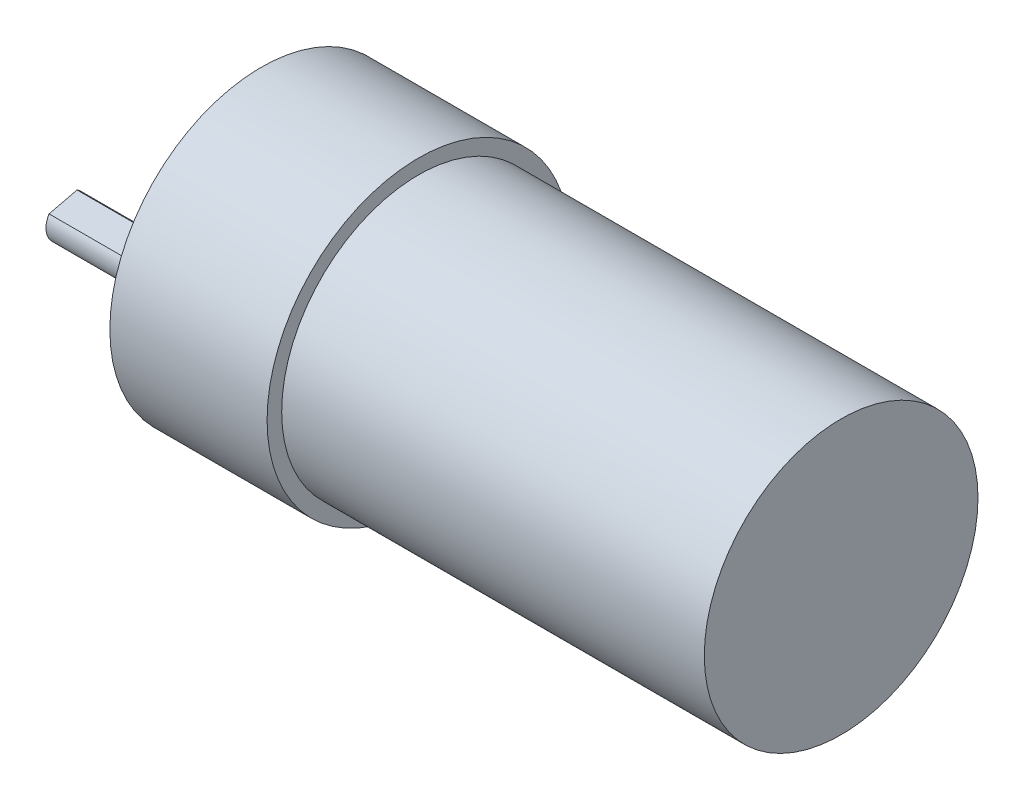
ISO-10303-21;
HEADER;
FILE_DESCRIPTION(('STEP AP214'),'2;1');
FILE_NAME('part.step','',(''),(''),'','','');
FILE_SCHEMA(('AUTOMOTIVE_DESIGN { 1 0 10303 214 1 1 1 1 }'));
ENDSEC;
DATA;
#1=APPLICATION_CONTEXT('core data for automotive mechanical design processes');
#2=APPLICATION_PROTOCOL_DEFINITION('international standard','automotive_design',2000,#1);
#3=PRODUCT_CONTEXT('',#1,'mechanical');
#4=PRODUCT('Part','Part','',(#3));
#5=PRODUCT_RELATED_PRODUCT_CATEGORY('part','',(#4));
#6=PRODUCT_DEFINITION_FORMATION('','',#4);
#7=PRODUCT_DEFINITION_CONTEXT('part definition',#1,'design');
#8=PRODUCT_DEFINITION('design','',#6,#7);
#9=PRODUCT_DEFINITION_SHAPE('','',#8);
#10=(LENGTH_UNIT() NAMED_UNIT(*) SI_UNIT(.MILLI.,.METRE.));
#11=(NAMED_UNIT(*) PLANE_ANGLE_UNIT() SI_UNIT($,.RADIAN.));
#12=(NAMED_UNIT(*) SI_UNIT($,.STERADIAN.) SOLID_ANGLE_UNIT());
#13=UNCERTAINTY_MEASURE_WITH_UNIT(LENGTH_MEASURE(1.E-05),#10,'distance_accuracy_value','');
#14=(GEOMETRIC_REPRESENTATION_CONTEXT(3) GLOBAL_UNCERTAINTY_ASSIGNED_CONTEXT((#13)) GLOBAL_UNIT_ASSIGNED_CONTEXT((#10,
#11,#12)) REPRESENTATION_CONTEXT('',''));
#15=CARTESIAN_POINT('',(0.,0.,0.));
#16=DIRECTION('',(0.,0.,1.));
#17=DIRECTION('',(1.,0.,0.));
#18=AXIS2_PLACEMENT_3D('',#15,#16,#17);
#19=CARTESIAN_POINT('',(-40.8432,-8.71855,0.));
#20=DIRECTION('',(1.,0.,0.));
#21=DIRECTION('',(0.,0.,-1.));
#22=AXIS2_PLACEMENT_3D('',#19,#20,#21);
#23=CYLINDRICAL_SURFACE('',#22,2.3749);
#24=CARTESIAN_POINT('',(-18.2372,-8.71855,0.));
#25=DIRECTION('',(-1.,0.,0.));
#26=DIRECTION('',(0.,0.,1.));
#27=AXIS2_PLACEMENT_3D('',#24,#25,#26);
#28=CIRCLE('',#27,2.3749);
#29=CARTESIAN_POINT('',(-18.2372,-8.71855,2.3749));
#30=VERTEX_POINT('',#29);
#31=EDGE_CURVE('E88',#30,#30,#28,.T.);
#32=ORIENTED_EDGE('',*,*,#31,.T.);
#33=EDGE_LOOP('',(#32));
#34=FACE_BOUND('',#33,.T.);
#35=DIRECTION('',(1.,0.,0.));
#36=VECTOR('',#35,1.);
#37=CARTESIAN_POINT('',(-40.8432,-6.68747817064265,-1.23081161596361));
#38=LINE('',#37,#36);
#39=CARTESIAN_POINT('',(-25.8572,-6.68747817064265,-1.23081161596361));
#40=VERTEX_POINT('',#39);
#41=CARTESIAN_POINT('',(-40.8432,-6.68747817064265,-1.23081161596361));
#42=VERTEX_POINT('',#41);
#43=EDGE_CURVE('E49',#40,#42,#38,.F.);
#44=ORIENTED_EDGE('',*,*,#43,.F.);
#45=CARTESIAN_POINT('',(-25.8572,-8.71855,0.));
#46=DIRECTION('',(1.,0.,0.));
#47=DIRECTION('',(0.,0.,-1.));
#48=AXIS2_PLACEMENT_3D('',#45,#46,#47);
#49=CIRCLE('',#48,2.3749);
#50=CARTESIAN_POINT('',(-25.8572,-7.46406700754952,2.01653723785416));
#51=VERTEX_POINT('',#50);
#52=EDGE_CURVE('E11',#40,#51,#49,.T.);
#53=ORIENTED_EDGE('',*,*,#52,.T.);
#54=DIRECTION('',(1.,0.,0.));
#55=VECTOR('',#54,1.);
#56=CARTESIAN_POINT('',(-40.8432,-7.46406700754952,2.01653723785416));
#57=LINE('',#56,#55);
#58=CARTESIAN_POINT('',(-40.8432,-7.46406700754952,2.01653723785416));
#59=VERTEX_POINT('',#58);
#60=EDGE_CURVE('E58',#59,#51,#57,.T.);
#61=ORIENTED_EDGE('',*,*,#60,.F.);
#62=CARTESIAN_POINT('',(-40.8432,-8.71855,0.));
#63=DIRECTION('',(-1.,0.,0.));
#64=DIRECTION('',(0.,0.,1.));
#65=AXIS2_PLACEMENT_3D('',#62,#63,#64);
#66=CIRCLE('',#65,2.3749);
#67=EDGE_CURVE('E70',#42,#59,#66,.T.);
#68=ORIENTED_EDGE('',*,*,#67,.F.);
#69=EDGE_LOOP('',(#44,#53,#61,#68));
#70=FACE_BOUND('',#69,.T.);
#71=ADVANCED_FACE('F34',(#34,#70),#23,.T.);
#72=CARTESIAN_POINT('',(-40.8432,-8.71855,0.));
#73=DIRECTION('',(-1.,0.,0.));
#74=DIRECTION('',(0.,0.,1.));
#75=AXIS2_PLACEMENT_3D('',#72,#73,#74);
#76=PLANE('',#75);
#77=ORIENTED_EDGE('',*,*,#67,.T.);
#78=DIRECTION('',(0.,0.232587064676617,-0.972575579245703));
#79=VECTOR('',#78,1.);
#80=CARTESIAN_POINT('',(-40.8432,-7.07577258909608,0.392862810945275));
#81=LINE('',#80,#79);
#82=EDGE_CURVE('E42',#59,#42,#81,.T.);
#83=ORIENTED_EDGE('',*,*,#82,.T.);
#84=EDGE_LOOP('',(#77,#83));
#85=FACE_BOUND('',#84,.T.);
#86=ADVANCED_FACE('F106',(#85),#76,.T.);
#87=CARTESIAN_POINT('',(-18.2372,0.,0.));
#88=DIRECTION('',(-1.,0.,0.));
#89=DIRECTION('',(0.,0.,1.));
#90=AXIS2_PLACEMENT_3D('',#87,#88,#89);
#91=PLANE('',#90);
#92=CARTESIAN_POINT('',(-18.2372,-8.71855,-10.2108));
#93=DIRECTION('',(-1.,0.,0.));
#94=DIRECTION('',(0.,0.,1.));
#95=AXIS2_PLACEMENT_3D('',#92,#93,#94);
#96=CIRCLE('',#95,1.27);
#97=CARTESIAN_POINT('',(-18.2372,-8.71855,-8.9408));
#98=VERTEX_POINT('',#97);
#99=EDGE_CURVE('E65',#98,#98,#96,.T.);
#100=ORIENTED_EDGE('',*,*,#99,.F.);
#101=EDGE_LOOP('',(#100));
#102=FACE_BOUND('',#101,.T.);
#103=CARTESIAN_POINT('',(-18.2372,-8.71855,10.2108));
#104=DIRECTION('',(-1.,0.,0.));
#105=DIRECTION('',(0.,0.,1.));
#106=AXIS2_PLACEMENT_3D('',#103,#104,#105);
#107=CIRCLE('',#106,1.27);
#108=CARTESIAN_POINT('',(-18.2372,-8.71855,11.4808));
#109=VERTEX_POINT('',#108);
#110=EDGE_CURVE('E76',#109,#109,#107,.T.);
#111=ORIENTED_EDGE('',*,*,#110,.F.);
#112=EDGE_LOOP('',(#111));
#113=FACE_BOUND('',#112,.T.);
#114=CARTESIAN_POINT('',(-18.2372,13.45565,0.));
#115=DIRECTION('',(-1.,0.,0.));
#116=DIRECTION('',(0.,0.,1.));
#117=AXIS2_PLACEMENT_3D('',#114,#115,#116);
#118=CIRCLE('',#117,1.27);
#119=CARTESIAN_POINT('',(-18.2372,13.45565,1.27));
#120=VERTEX_POINT('',#119);
#121=EDGE_CURVE('E82',#120,#120,#118,.T.);
#122=ORIENTED_EDGE('',*,*,#121,.F.);
#123=EDGE_LOOP('',(#122));
#124=FACE_BOUND('',#123,.T.);
#125=CARTESIAN_POINT('',(-18.2372,0.,0.));
#126=DIRECTION('',(-1.,0.,0.));
#127=DIRECTION('',(0.,0.,1.));
#128=AXIS2_PLACEMENT_3D('',#125,#126,#127);
#129=CIRCLE('',#128,17.56918);
#130=CARTESIAN_POINT('',(-18.2372,0.,17.56918));
#131=VERTEX_POINT('',#130);
#132=EDGE_CURVE('E95',#131,#131,#129,.T.);
#133=ORIENTED_EDGE('',*,*,#132,.T.);
#134=EDGE_LOOP('',(#133));
#135=FACE_BOUND('',#134,.T.);
#136=ORIENTED_EDGE('',*,*,#31,.F.);
#137=EDGE_LOOP('',(#136));
#138=FACE_BOUND('',#137,.T.);
#139=ADVANCED_FACE('F108',(#102,#113,#124,#135,#138),#91,.T.);
#140=CARTESIAN_POINT('',(49.022,0.,0.));
#141=DIRECTION('',(-1.,0.,0.));
#142=DIRECTION('',(0.,0.,1.));
#143=AXIS2_PLACEMENT_3D('',#140,#141,#142);
#144=CYLINDRICAL_SURFACE('',#143,15.875);
#145=CARTESIAN_POINT('',(49.022,0.,0.));
#146=DIRECTION('',(1.,0.,0.));
#147=DIRECTION('',(0.,0.,-1.));
#148=AXIS2_PLACEMENT_3D('',#145,#146,#147);
#149=CIRCLE('',#148,15.875);
#150=CARTESIAN_POINT('',(49.022,0.,-15.875));
#151=VERTEX_POINT('',#150);
#152=EDGE_CURVE('E103',#151,#151,#149,.T.);
#153=ORIENTED_EDGE('',*,*,#152,.F.);
#154=EDGE_LOOP('',(#153));
#155=FACE_BOUND('',#154,.T.);
#156=CARTESIAN_POINT('',(0.,0.,0.));
#157=DIRECTION('',(-1.,0.,0.));
#158=DIRECTION('',(0.,0.,1.));
#159=AXIS2_PLACEMENT_3D('',#156,#157,#158);
#160=CIRCLE('',#159,15.875);
#161=CARTESIAN_POINT('',(0.,0.,15.875));
#162=VERTEX_POINT('',#161);
#163=EDGE_CURVE('E98',#162,#162,#160,.T.);
#164=ORIENTED_EDGE('',*,*,#163,.F.);
#165=EDGE_LOOP('',(#164));
#166=FACE_BOUND('',#165,.T.);
#167=ADVANCED_FACE('F36',(#155,#166),#144,.T.);
#168=CARTESIAN_POINT('',(49.022,0.,0.));
#169=DIRECTION('',(1.,0.,0.));
#170=DIRECTION('',(0.,0.,-1.));
#171=AXIS2_PLACEMENT_3D('',#168,#169,#170);
#172=PLANE('',#171);
#173=ORIENTED_EDGE('',*,*,#152,.T.);
#174=EDGE_LOOP('',(#173));
#175=FACE_BOUND('',#174,.T.);
#176=ADVANCED_FACE('F126',(#175),#172,.T.);
#177=CARTESIAN_POINT('',(0.,0.,0.));
#178=DIRECTION('',(-1.,0.,0.));
#179=DIRECTION('',(0.,0.,1.));
#180=AXIS2_PLACEMENT_3D('',#177,#178,#179);
#181=PLANE('',#180);
#182=CARTESIAN_POINT('',(0.,0.,0.));
#183=DIRECTION('',(-1.,0.,0.));
#184=DIRECTION('',(0.,0.,1.));
#185=AXIS2_PLACEMENT_3D('',#182,#183,#184);
#186=CIRCLE('',#185,17.56918);
#187=CARTESIAN_POINT('',(0.,0.,17.56918));
#188=VERTEX_POINT('',#187);
#189=EDGE_CURVE('E92',#188,#188,#186,.T.);
#190=ORIENTED_EDGE('',*,*,#189,.F.);
#191=EDGE_LOOP('',(#190));
#192=FACE_BOUND('',#191,.T.);
#193=ORIENTED_EDGE('',*,*,#163,.T.);
#194=EDGE_LOOP('',(#193));
#195=FACE_BOUND('',#194,.T.);
#196=ADVANCED_FACE('F122',(#192,#195),#181,.F.);
#197=CARTESIAN_POINT('',(-18.2372,0.,0.));
#198=DIRECTION('',(1.,0.,0.));
#199=DIRECTION('',(0.,0.,-1.));
#200=AXIS2_PLACEMENT_3D('',#197,#198,#199);
#201=CYLINDRICAL_SURFACE('',#200,17.56918);
#202=ORIENTED_EDGE('',*,*,#132,.F.);
#203=EDGE_LOOP('',(#202));
#204=FACE_BOUND('',#203,.T.);
#205=ORIENTED_EDGE('',*,*,#189,.T.);
#206=EDGE_LOOP('',(#205));
#207=FACE_BOUND('',#206,.T.);
#208=ADVANCED_FACE('F125',(#204,#207),#201,.T.);
#209=CARTESIAN_POINT('',(-8.2372,13.45565,0.));
#210=DIRECTION('',(-1.,0.,0.));
#211=DIRECTION('',(0.,0.,1.));
#212=AXIS2_PLACEMENT_3D('',#209,#210,#211);
#213=CYLINDRICAL_SURFACE('',#212,1.27);
#214=CARTESIAN_POINT('',(-8.2372,13.45565,0.));
#215=DIRECTION('',(-1.,0.,0.));
#216=DIRECTION('',(0.,0.,1.));
#217=AXIS2_PLACEMENT_3D('',#214,#215,#216);
#218=CIRCLE('',#217,1.27);
#219=CARTESIAN_POINT('',(-8.2372,13.45565,1.27));
#220=VERTEX_POINT('',#219);
#221=EDGE_CURVE('E85',#220,#220,#218,.T.);
#222=ORIENTED_EDGE('',*,*,#221,.F.);
#223=EDGE_LOOP('',(#222));
#224=FACE_BOUND('',#223,.T.);
#225=ORIENTED_EDGE('',*,*,#121,.T.);
#226=EDGE_LOOP('',(#225));
#227=FACE_BOUND('',#226,.T.);
#228=ADVANCED_FACE('F119',(#224,#227),#213,.F.);
#229=CARTESIAN_POINT('',(-8.2372,13.45565,0.));
#230=DIRECTION('',(-1.,0.,0.));
#231=DIRECTION('',(0.,0.,1.));
#232=AXIS2_PLACEMENT_3D('',#229,#230,#231);
#233=PLANE('',#232);
#234=ORIENTED_EDGE('',*,*,#221,.T.);
#235=EDGE_LOOP('',(#234));
#236=FACE_BOUND('',#235,.T.);
#237=ADVANCED_FACE('F213',(#236),#233,.T.);
#238=CARTESIAN_POINT('',(-8.2372,-8.71855,10.2108));
#239=DIRECTION('',(-1.,0.,0.));
#240=DIRECTION('',(0.,0.,1.));
#241=AXIS2_PLACEMENT_3D('',#238,#239,#240);
#242=CYLINDRICAL_SURFACE('',#241,1.27);
#243=CARTESIAN_POINT('',(-8.2372,-8.71855,10.2108));
#244=DIRECTION('',(-1.,0.,0.));
#245=DIRECTION('',(0.,0.,1.));
#246=AXIS2_PLACEMENT_3D('',#243,#244,#245);
#247=CIRCLE('',#246,1.27);
#248=CARTESIAN_POINT('',(-8.2372,-8.71855,11.4808));
#249=VERTEX_POINT('',#248);
#250=EDGE_CURVE('E79',#249,#249,#247,.T.);
#251=ORIENTED_EDGE('',*,*,#250,.F.);
#252=EDGE_LOOP('',(#251));
#253=FACE_BOUND('',#252,.T.);
#254=ORIENTED_EDGE('',*,*,#110,.T.);
#255=EDGE_LOOP('',(#254));
#256=FACE_BOUND('',#255,.T.);
#257=ADVANCED_FACE('F206',(#253,#256),#242,.F.);
#258=CARTESIAN_POINT('',(-8.2372,-8.71855,10.2108));
#259=DIRECTION('',(-1.,0.,0.));
#260=DIRECTION('',(0.,0.,1.));
#261=AXIS2_PLACEMENT_3D('',#258,#259,#260);
#262=PLANE('',#261);
#263=ORIENTED_EDGE('',*,*,#250,.T.);
#264=EDGE_LOOP('',(#263));
#265=FACE_BOUND('',#264,.T.);
#266=ADVANCED_FACE('F198',(#265),#262,.T.);
#267=CARTESIAN_POINT('',(-8.2372,-8.71855,-10.2108));
#268=DIRECTION('',(-1.,0.,0.));
#269=DIRECTION('',(0.,0.,1.));
#270=AXIS2_PLACEMENT_3D('',#267,#268,#269);
#271=CYLINDRICAL_SURFACE('',#270,1.27);
#272=CARTESIAN_POINT('',(-8.2372,-8.71855,-10.2108));
#273=DIRECTION('',(-1.,0.,0.));
#274=DIRECTION('',(0.,0.,1.));
#275=AXIS2_PLACEMENT_3D('',#272,#273,#274);
#276=CIRCLE('',#275,1.27);
#277=CARTESIAN_POINT('',(-8.2372,-8.71855,-8.9408));
#278=VERTEX_POINT('',#277);
#279=EDGE_CURVE('E73',#278,#278,#276,.T.);
#280=ORIENTED_EDGE('',*,*,#279,.F.);
#281=EDGE_LOOP('',(#280));
#282=FACE_BOUND('',#281,.T.);
#283=ORIENTED_EDGE('',*,*,#99,.T.);
#284=EDGE_LOOP('',(#283));
#285=FACE_BOUND('',#284,.T.);
#286=ADVANCED_FACE('F190',(#282,#285),#271,.F.);
#287=CARTESIAN_POINT('',(-8.2372,-8.71855,-10.2108));
#288=DIRECTION('',(-1.,0.,0.));
#289=DIRECTION('',(0.,0.,1.));
#290=AXIS2_PLACEMENT_3D('',#287,#288,#289);
#291=PLANE('',#290);
#292=ORIENTED_EDGE('',*,*,#279,.T.);
#293=EDGE_LOOP('',(#292));
#294=FACE_BOUND('',#293,.T.);
#295=ADVANCED_FACE('F184',(#294),#291,.T.);
#296=CARTESIAN_POINT('',(-25.8572,-8.21958385216718,5.17577239912827));
#297=DIRECTION('',(1.,0.,0.));
#298=DIRECTION('',(0.,0.,-1.));
#299=AXIS2_PLACEMENT_3D('',#296,#297,#298);
#300=PLANE('',#299);
#301=DIRECTION('',(0.,0.232587064676617,-0.972575579245703));
#302=VECTOR('',#301,1.);
#303=CARTESIAN_POINT('',(-25.8572,-8.21958385216718,5.17577239912827));
#304=LINE('',#303,#302);
#305=EDGE_CURVE('E61',#51,#40,#304,.T.);
#306=ORIENTED_EDGE('',*,*,#305,.F.);
#307=ORIENTED_EDGE('',*,*,#52,.F.);
#308=EDGE_LOOP('',(#306,#307));
#309=FACE_BOUND('',#308,.T.);
#310=ADVANCED_FACE('F68',(#309),#300,.F.);
#311=CARTESIAN_POINT('',(-25.8572,-5.65789785603313,-5.5360582222337));
#312=DIRECTION('',(0.,0.972575579245703,0.232587064676617));
#313=DIRECTION('',(0.,-0.232587064676617,0.972575579245703));
#314=AXIS2_PLACEMENT_3D('',#311,#312,#313);
#315=PLANE('',#314);
#316=ORIENTED_EDGE('',*,*,#60,.T.);
#317=ORIENTED_EDGE('',*,*,#305,.T.);
#318=ORIENTED_EDGE('',*,*,#43,.T.);
#319=ORIENTED_EDGE('',*,*,#82,.F.);
#320=EDGE_LOOP('',(#316,#317,#318,#319));
#321=FACE_BOUND('',#320,.T.);
#322=ADVANCED_FACE('F60',(#321),#315,.T.);
#323=CLOSED_SHELL('',(#71,#86,#139,#167,#176,#196,#208,#228,#237,#257,#266,#286,#295,#310,#322));
#324=MANIFOLD_SOLID_BREP('B2',#323);
#325=ADVANCED_BREP_SHAPE_REPRESENTATION('',(#18,#324),#14);
#326=SHAPE_DEFINITION_REPRESENTATION(#9,#325);
ENDSEC;
END-ISO-10303-21;
